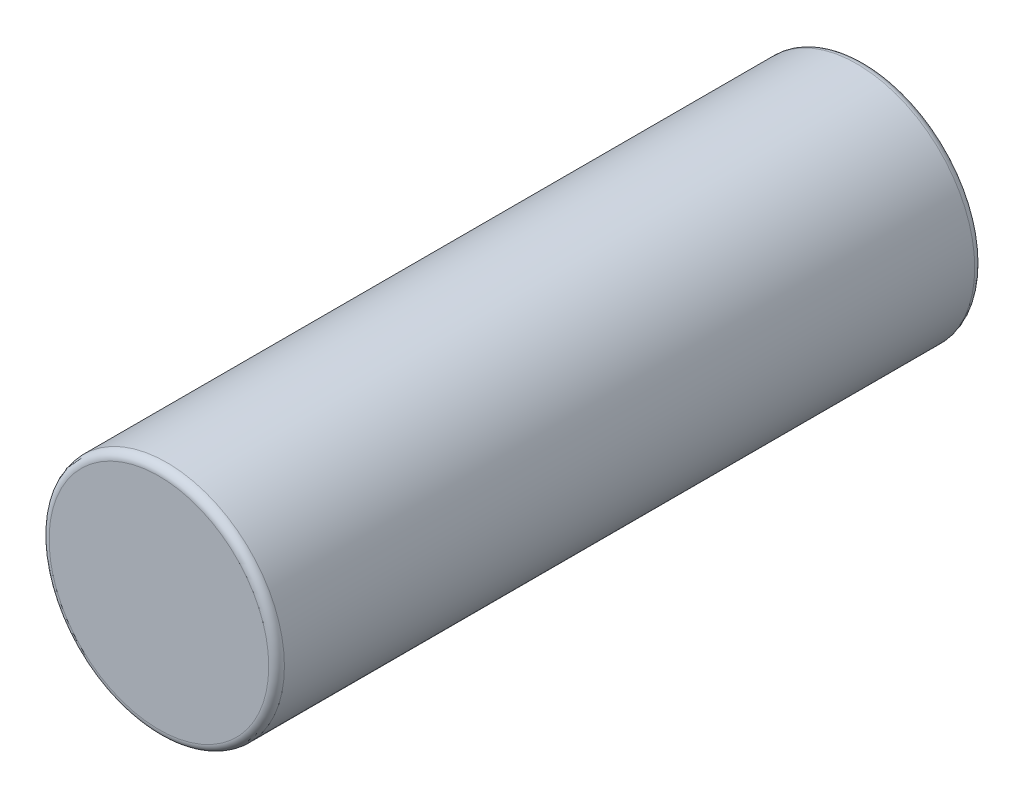
ISO-10303-21;
HEADER;
FILE_DESCRIPTION(('STEP AP214'),'2;1');
FILE_NAME('part.step','',(''),(''),'','','');
FILE_SCHEMA(('AUTOMOTIVE_DESIGN { 1 0 10303 214 1 1 1 1 }'));
ENDSEC;
DATA;
#1=APPLICATION_CONTEXT('core data for automotive mechanical design processes');
#2=APPLICATION_PROTOCOL_DEFINITION('international standard','automotive_design',2000,#1);
#3=PRODUCT_CONTEXT('',#1,'mechanical');
#4=PRODUCT('Part','Part','',(#3));
#5=PRODUCT_RELATED_PRODUCT_CATEGORY('part','',(#4));
#6=PRODUCT_DEFINITION_FORMATION('','',#4);
#7=PRODUCT_DEFINITION_CONTEXT('part definition',#1,'design');
#8=PRODUCT_DEFINITION('design','',#6,#7);
#9=PRODUCT_DEFINITION_SHAPE('','',#8);
#10=(LENGTH_UNIT() NAMED_UNIT(*) SI_UNIT(.MILLI.,.METRE.));
#11=(NAMED_UNIT(*) PLANE_ANGLE_UNIT() SI_UNIT($,.RADIAN.));
#12=(NAMED_UNIT(*) SI_UNIT($,.STERADIAN.) SOLID_ANGLE_UNIT());
#13=UNCERTAINTY_MEASURE_WITH_UNIT(LENGTH_MEASURE(1.E-05),#10,'distance_accuracy_value','');
#14=(GEOMETRIC_REPRESENTATION_CONTEXT(3) GLOBAL_UNCERTAINTY_ASSIGNED_CONTEXT((#13)) GLOBAL_UNIT_ASSIGNED_CONTEXT((#10,
#11,#12)) REPRESENTATION_CONTEXT('',''));
#15=CARTESIAN_POINT('',(0.,0.,0.));
#16=DIRECTION('',(0.,0.,1.));
#17=DIRECTION('',(1.,0.,0.));
#18=AXIS2_PLACEMENT_3D('',#15,#16,#17);
#19=CARTESIAN_POINT('',(0.,0.,-2.25));
#20=DIRECTION('',(0.,0.,1.));
#21=DIRECTION('',(1.,0.,0.));
#22=AXIS2_PLACEMENT_3D('',#19,#20,#21);
#23=CYLINDRICAL_SURFACE('',#22,0.75);
#24=CARTESIAN_POINT('',(0.,0.,-2.2));
#25=DIRECTION('',(0.,0.,1.));
#26=DIRECTION('',(1.,0.,0.));
#27=AXIS2_PLACEMENT_3D('',#24,#25,#26);
#28=CIRCLE('',#27,0.75);
#29=CARTESIAN_POINT('',(0.75,0.,-2.2));
#30=VERTEX_POINT('',#29);
#31=EDGE_CURVE('E41',#30,#30,#28,.T.);
#32=ORIENTED_EDGE('',*,*,#31,.T.);
#33=EDGE_LOOP('',(#32));
#34=FACE_BOUND('',#33,.T.);
#35=CARTESIAN_POINT('',(0.,0.,2.2));
#36=DIRECTION('',(0.,0.,1.));
#37=DIRECTION('',(1.,0.,0.));
#38=AXIS2_PLACEMENT_3D('',#35,#36,#37);
#39=CIRCLE('',#38,0.75);
#40=CARTESIAN_POINT('',(0.75,0.,2.2));
#41=VERTEX_POINT('',#40);
#42=EDGE_CURVE('E45',#41,#41,#39,.F.);
#43=ORIENTED_EDGE('',*,*,#42,.T.);
#44=EDGE_LOOP('',(#43));
#45=FACE_BOUND('',#44,.T.);
#46=ADVANCED_FACE('F30',(#34,#45),#23,.T.);
#47=CARTESIAN_POINT('',(0.,0.,-2.25));
#48=DIRECTION('',(0.,0.,1.));
#49=DIRECTION('',(1.,0.,0.));
#50=AXIS2_PLACEMENT_3D('',#47,#48,#49);
#51=PLANE('',#50);
#52=CARTESIAN_POINT('',(0.,0.,-2.25));
#53=DIRECTION('',(0.,0.,1.));
#54=DIRECTION('',(1.,0.,0.));
#55=AXIS2_PLACEMENT_3D('',#52,#53,#54);
#56=CIRCLE('',#55,0.7);
#57=CARTESIAN_POINT('',(0.7,0.,-2.25));
#58=VERTEX_POINT('',#57);
#59=EDGE_CURVE('E37',#58,#58,#56,.F.);
#60=ORIENTED_EDGE('',*,*,#59,.T.);
#61=EDGE_LOOP('',(#60));
#62=FACE_BOUND('',#61,.T.);
#63=ADVANCED_FACE('F61',(#62),#51,.F.);
#64=CARTESIAN_POINT('',(0.,0.,2.25));
#65=DIRECTION('',(0.,0.,1.));
#66=DIRECTION('',(1.,0.,0.));
#67=AXIS2_PLACEMENT_3D('',#64,#65,#66);
#68=PLANE('',#67);
#69=CARTESIAN_POINT('',(0.,0.,2.25));
#70=DIRECTION('',(0.,0.,1.));
#71=DIRECTION('',(1.,0.,0.));
#72=AXIS2_PLACEMENT_3D('',#69,#70,#71);
#73=CIRCLE('',#72,0.7);
#74=CARTESIAN_POINT('',(0.7,0.,2.25));
#75=VERTEX_POINT('',#74);
#76=EDGE_CURVE('E10',#75,#75,#73,.T.);
#77=ORIENTED_EDGE('',*,*,#76,.T.);
#78=EDGE_LOOP('',(#77));
#79=FACE_BOUND('',#78,.T.);
#80=ADVANCED_FACE('F58',(#79),#68,.T.);
#81=CARTESIAN_POINT('',(0.,0.,-2.2));
#82=DIRECTION('',(0.,0.,1.));
#83=DIRECTION('',(1.,0.,0.));
#84=AXIS2_PLACEMENT_3D('',#81,#82,#83);
#85=TOROIDAL_SURFACE('',#84,0.7,0.05);
#86=ORIENTED_EDGE('',*,*,#59,.F.);
#87=EDGE_LOOP('',(#86));
#88=FACE_BOUND('',#87,.T.);
#89=ORIENTED_EDGE('',*,*,#31,.F.);
#90=EDGE_LOOP('',(#89));
#91=FACE_BOUND('',#90,.T.);
#92=ADVANCED_FACE('F54',(#88,#91),#85,.T.);
#93=CARTESIAN_POINT('',(0.,0.,2.2));
#94=DIRECTION('',(0.,0.,1.));
#95=DIRECTION('',(1.,0.,0.));
#96=AXIS2_PLACEMENT_3D('',#93,#94,#95);
#97=TOROIDAL_SURFACE('',#96,0.7,0.05);
#98=ORIENTED_EDGE('',*,*,#42,.F.);
#99=EDGE_LOOP('',(#98));
#100=FACE_BOUND('',#99,.T.);
#101=ORIENTED_EDGE('',*,*,#76,.F.);
#102=EDGE_LOOP('',(#101));
#103=FACE_BOUND('',#102,.T.);
#104=ADVANCED_FACE('F32',(#100,#103),#97,.T.);
#105=CLOSED_SHELL('',(#46,#63,#80,#92,#104));
#106=MANIFOLD_SOLID_BREP('B2',#105);
#107=ADVANCED_BREP_SHAPE_REPRESENTATION('',(#18,#106),#14);
#108=SHAPE_DEFINITION_REPRESENTATION(#9,#107);
ENDSEC;
END-ISO-10303-21;
